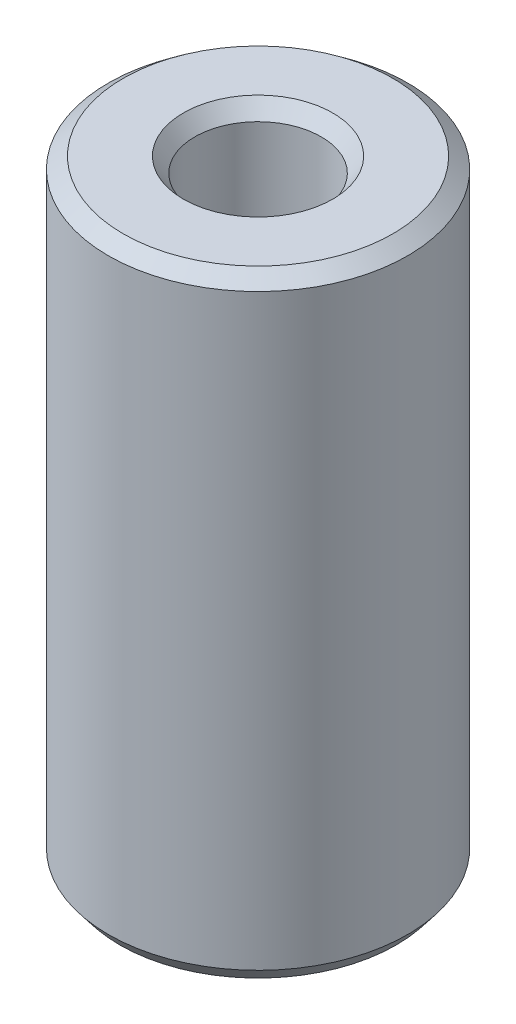
ISO-10303-21;
HEADER;
FILE_DESCRIPTION(('STEP AP214'),'2;1');
FILE_NAME('part.step','',(''),(''),'','','');
FILE_SCHEMA(('AUTOMOTIVE_DESIGN { 1 0 10303 214 1 1 1 1 }'));
ENDSEC;
DATA;
#1=APPLICATION_CONTEXT('core data for automotive mechanical design processes');
#2=APPLICATION_PROTOCOL_DEFINITION('international standard','automotive_design',2000,#1);
#3=PRODUCT_CONTEXT('',#1,'mechanical');
#4=PRODUCT('Part','Part','',(#3));
#5=PRODUCT_RELATED_PRODUCT_CATEGORY('part','',(#4));
#6=PRODUCT_DEFINITION_FORMATION('','',#4);
#7=PRODUCT_DEFINITION_CONTEXT('part definition',#1,'design');
#8=PRODUCT_DEFINITION('design','',#6,#7);
#9=PRODUCT_DEFINITION_SHAPE('','',#8);
#10=(LENGTH_UNIT() NAMED_UNIT(*) SI_UNIT(.MILLI.,.METRE.));
#11=(NAMED_UNIT(*) PLANE_ANGLE_UNIT() SI_UNIT($,.RADIAN.));
#12=(NAMED_UNIT(*) SI_UNIT($,.STERADIAN.) SOLID_ANGLE_UNIT());
#13=UNCERTAINTY_MEASURE_WITH_UNIT(LENGTH_MEASURE(1.E-05),#10,'distance_accuracy_value','');
#14=(GEOMETRIC_REPRESENTATION_CONTEXT(3) GLOBAL_UNCERTAINTY_ASSIGNED_CONTEXT((#13)) GLOBAL_UNIT_ASSIGNED_CONTEXT((#10,
#11,#12)) REPRESENTATION_CONTEXT('',''));
#15=CARTESIAN_POINT('',(0.,0.,0.));
#16=DIRECTION('',(0.,0.,1.));
#17=DIRECTION('',(1.,0.,0.));
#18=AXIS2_PLACEMENT_3D('',#15,#16,#17);
#19=CARTESIAN_POINT('',(0.,194.933264291701,0.));
#20=DIRECTION('',(0.,-1.,0.));
#21=DIRECTION('',(0.,0.,-1.));
#22=AXIS2_PLACEMENT_3D('',#19,#20,#21);
#23=CYLINDRICAL_SURFACE('',#22,47.5);
#24=CARTESIAN_POINT('',(0.,4.7265665893558,0.));
#25=DIRECTION('',(0.,1.,0.));
#26=DIRECTION('',(0.,0.,1.));
#27=AXIS2_PLACEMENT_3D('',#24,#25,#26);
#28=CIRCLE('',#27,47.5);
#29=CARTESIAN_POINT('',(0.,4.7265665893558,47.5));
#30=VERTEX_POINT('',#29);
#31=EDGE_CURVE('E10',#30,#30,#28,.T.);
#32=ORIENTED_EDGE('',*,*,#31,.T.);
#33=EDGE_LOOP('',(#32));
#34=FACE_BOUND('',#33,.T.);
#35=CARTESIAN_POINT('',(0.,191.272180752793,0.));
#36=DIRECTION('',(0.,1.,0.));
#37=DIRECTION('',(0.,0.,1.));
#38=AXIS2_PLACEMENT_3D('',#35,#36,#37);
#39=CIRCLE('',#38,47.5);
#40=CARTESIAN_POINT('',(0.,191.272180752793,47.5));
#41=VERTEX_POINT('',#40);
#42=EDGE_CURVE('E50',#41,#41,#39,.F.);
#43=ORIENTED_EDGE('',*,*,#42,.T.);
#44=EDGE_LOOP('',(#43));
#45=FACE_BOUND('',#44,.T.);
#46=ADVANCED_FACE('F39',(#34,#45),#23,.T.);
#47=CARTESIAN_POINT('',(0.,194.933264291701,0.));
#48=DIRECTION('',(0.,1.,0.));
#49=DIRECTION('',(0.,0.,1.));
#50=AXIS2_PLACEMENT_3D('',#47,#48,#49);
#51=PLANE('',#50);
#52=CARTESIAN_POINT('',(0.,194.933264291701,0.));
#53=DIRECTION('',(0.,1.,0.));
#54=DIRECTION('',(0.,0.,1.));
#55=AXIS2_PLACEMENT_3D('',#52,#53,#54);
#56=CIRCLE('',#55,23.7110319549646);
#57=CARTESIAN_POINT('',(0.,194.933264291701,23.7110319549646));
#58=VERTEX_POINT('',#57);
#59=EDGE_CURVE('E58',#58,#58,#56,.F.);
#60=ORIENTED_EDGE('',*,*,#59,.T.);
#61=EDGE_LOOP('',(#60));
#62=FACE_BOUND('',#61,.T.);
#63=CARTESIAN_POINT('',(0.,194.933264291701,0.));
#64=DIRECTION('',(0.,1.,0.));
#65=DIRECTION('',(0.,0.,1.));
#66=AXIS2_PLACEMENT_3D('',#63,#64,#65);
#67=CIRCLE('',#66,42.7734334106442);
#68=CARTESIAN_POINT('',(0.,194.933264291701,42.7734334106442));
#69=VERTEX_POINT('',#68);
#70=EDGE_CURVE('E61',#69,#69,#67,.T.);
#71=ORIENTED_EDGE('',*,*,#70,.T.);
#72=EDGE_LOOP('',(#71));
#73=FACE_BOUND('',#72,.T.);
#74=ADVANCED_FACE('F88',(#62,#73),#51,.T.);
#75=CARTESIAN_POINT('',(0.,0.,0.));
#76=DIRECTION('',(0.,1.,0.));
#77=DIRECTION('',(0.,0.,1.));
#78=AXIS2_PLACEMENT_3D('',#75,#76,#77);
#79=PLANE('',#78);
#80=CARTESIAN_POINT('',(0.,0.,0.));
#81=DIRECTION('',(0.,1.,0.));
#82=DIRECTION('',(0.,0.,1.));
#83=AXIS2_PLACEMENT_3D('',#80,#81,#82);
#84=CIRCLE('',#83,24.7765150054125);
#85=CARTESIAN_POINT('',(0.,0.,24.7765150054125));
#86=VERTEX_POINT('',#85);
#87=EDGE_CURVE('E51',#86,#86,#84,.T.);
#88=ORIENTED_EDGE('',*,*,#87,.T.);
#89=EDGE_LOOP('',(#88));
#90=FACE_BOUND('',#89,.T.);
#91=CARTESIAN_POINT('',(0.,0.,0.));
#92=DIRECTION('',(0.,1.,0.));
#93=DIRECTION('',(0.,0.,1.));
#94=AXIS2_PLACEMENT_3D('',#91,#92,#93);
#95=CIRCLE('',#94,43.838916461092);
#96=CARTESIAN_POINT('',(0.,0.,43.838916461092));
#97=VERTEX_POINT('',#96);
#98=EDGE_CURVE('E54',#97,#97,#95,.F.);
#99=ORIENTED_EDGE('',*,*,#98,.T.);
#100=EDGE_LOOP('',(#99));
#101=FACE_BOUND('',#100,.T.);
#102=ADVANCED_FACE('F83',(#90,#101),#79,.F.);
#103=CARTESIAN_POINT('',(0.,194.933264291701,0.));
#104=DIRECTION('',(0.,-1.,0.));
#105=DIRECTION('',(0.,0.,-1.));
#106=AXIS2_PLACEMENT_3D('',#103,#104,#105);
#107=CYLINDRICAL_SURFACE('',#106,20.0499484160567);
#108=CARTESIAN_POINT('',(0.,190.206697702345,0.));
#109=DIRECTION('',(0.,1.,0.));
#110=DIRECTION('',(0.,0.,1.));
#111=AXIS2_PLACEMENT_3D('',#108,#109,#110);
#112=CIRCLE('',#111,20.0499484160567);
#113=CARTESIAN_POINT('',(0.,190.206697702345,20.0499484160567));
#114=VERTEX_POINT('',#113);
#115=EDGE_CURVE('E67',#114,#114,#112,.T.);
#116=ORIENTED_EDGE('',*,*,#115,.T.);
#117=EDGE_LOOP('',(#116));
#118=FACE_BOUND('',#117,.T.);
#119=CARTESIAN_POINT('',(0.,3.66108353890798,0.));
#120=DIRECTION('',(0.,1.,0.));
#121=DIRECTION('',(0.,0.,1.));
#122=AXIS2_PLACEMENT_3D('',#119,#120,#121);
#123=CIRCLE('',#122,20.0499484160567);
#124=CARTESIAN_POINT('',(0.,3.66108353890798,20.0499484160567));
#125=VERTEX_POINT('',#124);
#126=EDGE_CURVE('E69',#125,#125,#123,.F.);
#127=ORIENTED_EDGE('',*,*,#126,.T.);
#128=EDGE_LOOP('',(#127));
#129=FACE_BOUND('',#128,.T.);
#130=ADVANCED_FACE('F71',(#118,#129),#107,.F.);
#131=CARTESIAN_POINT('',(0.,190.206697702345,0.));
#132=DIRECTION('',(0.,1.,0.));
#133=DIRECTION('',(0.,0.,1.));
#134=AXIS2_PLACEMENT_3D('',#131,#132,#133);
#135=CONICAL_SURFACE('',#134,20.0499484160567,0.659044918593062);
#136=ORIENTED_EDGE('',*,*,#59,.F.);
#137=EDGE_LOOP('',(#136));
#138=FACE_BOUND('',#137,.T.);
#139=ORIENTED_EDGE('',*,*,#115,.F.);
#140=EDGE_LOOP('',(#139));
#141=FACE_BOUND('',#140,.T.);
#142=ADVANCED_FACE('F77',(#138,#141),#135,.F.);
#143=CARTESIAN_POINT('',(0.,0.,0.));
#144=DIRECTION('',(0.,-1.,0.));
#145=DIRECTION('',(0.,0.,-1.));
#146=AXIS2_PLACEMENT_3D('',#143,#144,#145);
#147=CONICAL_SURFACE('',#146,24.7765150054125,0.911751408201831);
#148=ORIENTED_EDGE('',*,*,#126,.F.);
#149=EDGE_LOOP('',(#148));
#150=FACE_BOUND('',#149,.T.);
#151=ORIENTED_EDGE('',*,*,#87,.F.);
#152=EDGE_LOOP('',(#151));
#153=FACE_BOUND('',#152,.T.);
#154=ADVANCED_FACE('F73',(#150,#153),#147,.F.);
#155=CARTESIAN_POINT('',(0.,4.7265665893558,0.));
#156=DIRECTION('',(0.,1.,0.));
#157=DIRECTION('',(0.,0.,1.));
#158=AXIS2_PLACEMENT_3D('',#155,#156,#157);
#159=CONICAL_SURFACE('',#158,47.5,0.659044918593064);
#160=ORIENTED_EDGE('',*,*,#98,.F.);
#161=EDGE_LOOP('',(#160));
#162=FACE_BOUND('',#161,.T.);
#163=ORIENTED_EDGE('',*,*,#31,.F.);
#164=EDGE_LOOP('',(#163));
#165=FACE_BOUND('',#164,.T.);
#166=ADVANCED_FACE('F76',(#162,#165),#159,.T.);
#167=CARTESIAN_POINT('',(0.,194.933264291701,0.));
#168=DIRECTION('',(0.,-1.,0.));
#169=DIRECTION('',(0.,0.,-1.));
#170=AXIS2_PLACEMENT_3D('',#167,#168,#169);
#171=CONICAL_SURFACE('',#170,42.7734334106442,0.911751408201829);
#172=ORIENTED_EDGE('',*,*,#42,.F.);
#173=EDGE_LOOP('',(#172));
#174=FACE_BOUND('',#173,.T.);
#175=ORIENTED_EDGE('',*,*,#70,.F.);
#176=EDGE_LOOP('',(#175));
#177=FACE_BOUND('',#176,.T.);
#178=ADVANCED_FACE('F45',(#174,#177),#171,.T.);
#179=CLOSED_SHELL('',(#46,#74,#102,#130,#142,#154,#166,#178));
#180=MANIFOLD_SOLID_BREP('B2',#179);
#181=ADVANCED_BREP_SHAPE_REPRESENTATION('',(#18,#180),#14);
#182=SHAPE_DEFINITION_REPRESENTATION(#9,#181);
ENDSEC;
END-ISO-10303-21;
